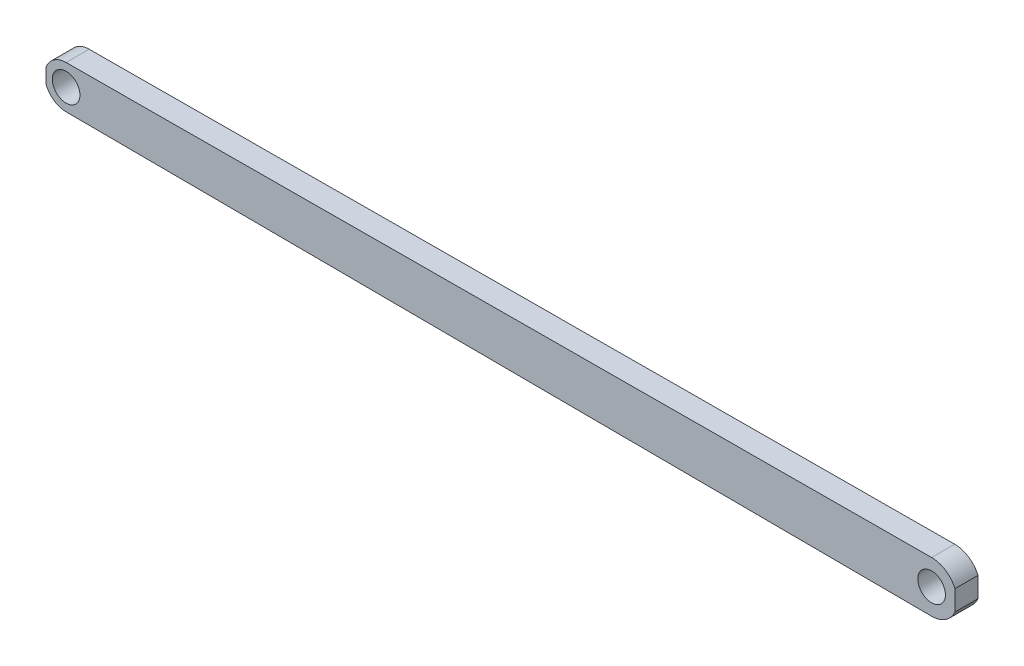
ISO-10303-21;
HEADER;
FILE_DESCRIPTION(('STEP AP214'),'2;1');
FILE_NAME('part.step','',(''),(''),'','','');
FILE_SCHEMA(('AUTOMOTIVE_DESIGN { 1 0 10303 214 1 1 1 1 }'));
ENDSEC;
DATA;
#1=APPLICATION_CONTEXT('core data for automotive mechanical design processes');
#2=APPLICATION_PROTOCOL_DEFINITION('international standard','automotive_design',2000,#1);
#3=PRODUCT_CONTEXT('',#1,'mechanical');
#4=PRODUCT('Part','Part','',(#3));
#5=PRODUCT_RELATED_PRODUCT_CATEGORY('part','',(#4));
#6=PRODUCT_DEFINITION_FORMATION('','',#4);
#7=PRODUCT_DEFINITION_CONTEXT('part definition',#1,'design');
#8=PRODUCT_DEFINITION('design','',#6,#7);
#9=PRODUCT_DEFINITION_SHAPE('','',#8);
#10=(LENGTH_UNIT() NAMED_UNIT(*) SI_UNIT(.MILLI.,.METRE.));
#11=(NAMED_UNIT(*) PLANE_ANGLE_UNIT() SI_UNIT($,.RADIAN.));
#12=(NAMED_UNIT(*) SI_UNIT($,.STERADIAN.) SOLID_ANGLE_UNIT());
#13=UNCERTAINTY_MEASURE_WITH_UNIT(LENGTH_MEASURE(1.E-05),#10,'distance_accuracy_value','');
#14=(GEOMETRIC_REPRESENTATION_CONTEXT(3) GLOBAL_UNCERTAINTY_ASSIGNED_CONTEXT((#13)) GLOBAL_UNIT_ASSIGNED_CONTEXT((#10,
#11,#12)) REPRESENTATION_CONTEXT('',''));
#15=CARTESIAN_POINT('',(0.,0.,0.));
#16=DIRECTION('',(0.,0.,1.));
#17=DIRECTION('',(1.,0.,0.));
#18=AXIS2_PLACEMENT_3D('',#15,#16,#17);
#19=CARTESIAN_POINT('',(0.,0.,5.));
#20=DIRECTION('',(0.,0.,1.));
#21=DIRECTION('',(1.,0.,0.));
#22=AXIS2_PLACEMENT_3D('',#19,#20,#21);
#23=PLANE('',#22);
#24=CARTESIAN_POINT('',(187.7624,0.,5.));
#25=DIRECTION('',(0.,0.,1.));
#26=DIRECTION('',(1.,0.,0.));
#27=AXIS2_PLACEMENT_3D('',#24,#25,#26);
#28=CIRCLE('',#27,3.00000007924962);
#29=CARTESIAN_POINT('',(190.76240007925,0.,5.));
#30=VERTEX_POINT('',#29);
#31=EDGE_CURVE('E168',#30,#30,#28,.T.);
#32=ORIENTED_EDGE('',*,*,#31,.F.);
#33=EDGE_LOOP('',(#32));
#34=FACE_BOUND('',#33,.T.);
#35=CARTESIAN_POINT('',(0.,0.,5.));
#36=DIRECTION('',(0.,0.,1.));
#37=DIRECTION('',(1.,0.,0.));
#38=AXIS2_PLACEMENT_3D('',#35,#36,#37);
#39=CIRCLE('',#38,3.00000007924961);
#40=CARTESIAN_POINT('',(3.00000007924961,0.,5.));
#41=VERTEX_POINT('',#40);
#42=EDGE_CURVE('E139',#41,#41,#39,.T.);
#43=ORIENTED_EDGE('',*,*,#42,.F.);
#44=EDGE_LOOP('',(#43));
#45=FACE_BOUND('',#44,.T.);
#46=CARTESIAN_POINT('',(0.,0.,5.));
#47=DIRECTION('',(0.,0.,1.));
#48=DIRECTION('',(1.,0.,0.));
#49=AXIS2_PLACEMENT_3D('',#46,#47,#48);
#50=CIRCLE('',#49,4.63518821296482);
#51=CARTESIAN_POINT('',(0.,4.63518821296482,5.));
#52=VERTEX_POINT('',#51);
#53=CARTESIAN_POINT('',(-4.35681947691644,1.58211687784739,5.));
#54=VERTEX_POINT('',#53);
#55=EDGE_CURVE('E153',#52,#54,#50,.T.);
#56=ORIENTED_EDGE('',*,*,#55,.T.);
#57=DIRECTION('',(0.,1.,0.));
#58=VECTOR('',#57,1.);
#59=CARTESIAN_POINT('',(-4.35681947691644,0.,5.));
#60=LINE('',#59,#58);
#61=CARTESIAN_POINT('',(-4.35681947691644,-1.58211687784739,5.));
#62=VERTEX_POINT('',#61);
#63=EDGE_CURVE('E100',#62,#54,#60,.T.);
#64=ORIENTED_EDGE('',*,*,#63,.F.);
#65=CARTESIAN_POINT('',(0.,-4.63518821296482,5.));
#66=VERTEX_POINT('',#65);
#67=EDGE_CURVE('E150',#62,#66,#50,.T.);
#68=ORIENTED_EDGE('',*,*,#67,.T.);
#69=DIRECTION('',(-0.999988830954034,0.00472630587074901,0.));
#70=VECTOR('',#69,1.);
#71=CARTESIAN_POINT('',(-0.0219070725791288,-4.63508467228263,5.));
#72=LINE('',#71,#70);
#73=CARTESIAN_POINT('',(187.7624,-5.52262065816452,5.));
#74=VERTEX_POINT('',#73);
#75=EDGE_CURVE('E159',#74,#66,#72,.T.);
#76=ORIENTED_EDGE('',*,*,#75,.F.);
#77=CARTESIAN_POINT('',(187.7624,0.,5.));
#78=DIRECTION('',(0.,0.,1.));
#79=DIRECTION('',(1.,0.,0.));
#80=AXIS2_PLACEMENT_3D('',#77,#78,#79);
#81=CIRCLE('',#80,5.52262065816452);
#82=CARTESIAN_POINT('',(192.829341952088,-2.19668800428204,5.));
#83=VERTEX_POINT('',#82);
#84=EDGE_CURVE('E165',#74,#83,#81,.T.);
#85=ORIENTED_EDGE('',*,*,#84,.T.);
#86=DIRECTION('',(0.,-1.,0.));
#87=VECTOR('',#86,1.);
#88=CARTESIAN_POINT('',(192.829341952088,0.,5.));
#89=LINE('',#88,#87);
#90=CARTESIAN_POINT('',(192.829341952088,2.19668800428204,5.));
#91=VERTEX_POINT('',#90);
#92=EDGE_CURVE('E154',#91,#83,#89,.T.);
#93=ORIENTED_EDGE('',*,*,#92,.F.);
#94=CARTESIAN_POINT('',(187.7624,5.52262065816452,5.));
#95=VERTEX_POINT('',#94);
#96=EDGE_CURVE('E164',#91,#95,#81,.T.);
#97=ORIENTED_EDGE('',*,*,#96,.T.);
#98=DIRECTION('',(-0.999988830954034,-0.00472630587074901,0.));
#99=VECTOR('',#98,1.);
#100=CARTESIAN_POINT('',(-0.0219070725791288,4.63508467228263,5.));
#101=LINE('',#100,#99);
#102=EDGE_CURVE('E134',#95,#52,#101,.T.);
#103=ORIENTED_EDGE('',*,*,#102,.T.);
#104=EDGE_LOOP('',(#56,#64,#68,#76,#85,#93,#97,#103));
#105=FACE_BOUND('',#104,.T.);
#106=ADVANCED_FACE('F36',(#34,#45,#105),#23,.T.);
#107=CARTESIAN_POINT('',(0.,0.,0.));
#108=DIRECTION('',(0.,0.,1.));
#109=DIRECTION('',(1.,0.,0.));
#110=AXIS2_PLACEMENT_3D('',#107,#108,#109);
#111=PLANE('',#110);
#112=CARTESIAN_POINT('',(187.7624,0.,0.));
#113=DIRECTION('',(0.,0.,1.));
#114=DIRECTION('',(1.,0.,0.));
#115=AXIS2_PLACEMENT_3D('',#112,#113,#114);
#116=CIRCLE('',#115,3.00000007924962);
#117=CARTESIAN_POINT('',(190.76240007925,0.,0.));
#118=VERTEX_POINT('',#117);
#119=EDGE_CURVE('E128',#118,#118,#116,.T.);
#120=ORIENTED_EDGE('',*,*,#119,.T.);
#121=EDGE_LOOP('',(#120));
#122=FACE_BOUND('',#121,.T.);
#123=CARTESIAN_POINT('',(0.,0.,0.));
#124=DIRECTION('',(0.,0.,1.));
#125=DIRECTION('',(1.,0.,0.));
#126=AXIS2_PLACEMENT_3D('',#123,#124,#125);
#127=CIRCLE('',#126,3.00000007924961);
#128=CARTESIAN_POINT('',(3.00000007924961,0.,0.));
#129=VERTEX_POINT('',#128);
#130=EDGE_CURVE('E131',#129,#129,#127,.T.);
#131=ORIENTED_EDGE('',*,*,#130,.T.);
#132=EDGE_LOOP('',(#131));
#133=FACE_BOUND('',#132,.T.);
#134=DIRECTION('',(0.,1.,0.));
#135=VECTOR('',#134,1.);
#136=CARTESIAN_POINT('',(-4.35681947691644,0.,0.));
#137=LINE('',#136,#135);
#138=CARTESIAN_POINT('',(-4.35681947691644,-1.58211687784739,0.));
#139=VERTEX_POINT('',#138);
#140=CARTESIAN_POINT('',(-4.35681947691644,1.58211687784739,0.));
#141=VERTEX_POINT('',#140);
#142=EDGE_CURVE('E50',#139,#141,#137,.T.);
#143=ORIENTED_EDGE('',*,*,#142,.T.);
#144=CARTESIAN_POINT('',(0.,0.,0.));
#145=DIRECTION('',(0.,0.,1.));
#146=DIRECTION('',(1.,0.,0.));
#147=AXIS2_PLACEMENT_3D('',#144,#145,#146);
#148=CIRCLE('',#147,4.63518821296482);
#149=CARTESIAN_POINT('',(0.,4.63518821296482,0.));
#150=VERTEX_POINT('',#149);
#151=EDGE_CURVE('E108',#150,#141,#148,.T.);
#152=ORIENTED_EDGE('',*,*,#151,.F.);
#153=DIRECTION('',(-0.999988830954034,-0.00472630587074901,0.));
#154=VECTOR('',#153,1.);
#155=CARTESIAN_POINT('',(-0.0219070725791288,4.63508467228263,0.));
#156=LINE('',#155,#154);
#157=CARTESIAN_POINT('',(187.7624,5.52262065816452,0.));
#158=VERTEX_POINT('',#157);
#159=EDGE_CURVE('E121',#158,#150,#156,.T.);
#160=ORIENTED_EDGE('',*,*,#159,.F.);
#161=CARTESIAN_POINT('',(187.7624,0.,0.));
#162=DIRECTION('',(0.,0.,1.));
#163=DIRECTION('',(1.,0.,0.));
#164=AXIS2_PLACEMENT_3D('',#161,#162,#163);
#165=CIRCLE('',#164,5.52262065816452);
#166=CARTESIAN_POINT('',(192.829341952088,2.19668800428204,0.));
#167=VERTEX_POINT('',#166);
#168=EDGE_CURVE('E119',#167,#158,#165,.T.);
#169=ORIENTED_EDGE('',*,*,#168,.F.);
#170=DIRECTION('',(0.,1.,0.));
#171=VECTOR('',#170,1.);
#172=CARTESIAN_POINT('',(192.829341952088,0.,0.));
#173=LINE('',#172,#171);
#174=CARTESIAN_POINT('',(192.829341952088,-2.19668800428204,0.));
#175=VERTEX_POINT('',#174);
#176=EDGE_CURVE('E145',#175,#167,#173,.T.);
#177=ORIENTED_EDGE('',*,*,#176,.F.);
#178=CARTESIAN_POINT('',(187.7624,-5.52262065816452,0.));
#179=VERTEX_POINT('',#178);
#180=EDGE_CURVE('E125',#179,#175,#165,.T.);
#181=ORIENTED_EDGE('',*,*,#180,.F.);
#182=DIRECTION('',(-0.999988830954034,0.00472630587074901,0.));
#183=VECTOR('',#182,1.);
#184=CARTESIAN_POINT('',(-0.0219070725791288,-4.63508467228263,0.));
#185=LINE('',#184,#183);
#186=CARTESIAN_POINT('',(0.,-4.63518821296482,0.));
#187=VERTEX_POINT('',#186);
#188=EDGE_CURVE('E117',#179,#187,#185,.T.);
#189=ORIENTED_EDGE('',*,*,#188,.T.);
#190=EDGE_CURVE('E111',#139,#187,#148,.T.);
#191=ORIENTED_EDGE('',*,*,#190,.F.);
#192=EDGE_LOOP('',(#143,#152,#160,#169,#177,#181,#189,#191));
#193=FACE_BOUND('',#192,.T.);
#194=ADVANCED_FACE('F106',(#122,#133,#193),#111,.F.);
#195=CARTESIAN_POINT('',(0.,0.,5.));
#196=DIRECTION('',(0.,0.,-1.));
#197=DIRECTION('',(-1.,0.,0.));
#198=AXIS2_PLACEMENT_3D('',#195,#196,#197);
#199=CYLINDRICAL_SURFACE('',#198,4.63518821296482);
#200=DIRECTION('',(0.,0.,-1.));
#201=VECTOR('',#200,1.);
#202=CARTESIAN_POINT('',(-4.35681947691644,1.58211687784739,5.));
#203=LINE('',#202,#201);
#204=EDGE_CURVE('E11',#54,#141,#203,.T.);
#205=ORIENTED_EDGE('',*,*,#204,.F.);
#206=ORIENTED_EDGE('',*,*,#55,.F.);
#207=DIRECTION('',(0.,0.,-1.));
#208=VECTOR('',#207,1.);
#209=CARTESIAN_POINT('',(0.,4.63518821296482,5.));
#210=LINE('',#209,#208);
#211=EDGE_CURVE('E115',#52,#150,#210,.T.);
#212=ORIENTED_EDGE('',*,*,#211,.T.);
#213=ORIENTED_EDGE('',*,*,#151,.T.);
#214=EDGE_LOOP('',(#205,#206,#212,#213));
#215=FACE_BOUND('',#214,.T.);
#216=ADVANCED_FACE('F113',(#215),#199,.T.);
#217=DIRECTION('',(0.,0.,-1.));
#218=VECTOR('',#217,1.);
#219=CARTESIAN_POINT('',(-4.35681947691644,-1.58211687784739,5.));
#220=LINE('',#219,#218);
#221=EDGE_CURVE('E44',#139,#62,#220,.F.);
#222=ORIENTED_EDGE('',*,*,#221,.F.);
#223=ORIENTED_EDGE('',*,*,#190,.T.);
#224=DIRECTION('',(0.,0.,-1.));
#225=VECTOR('',#224,1.);
#226=CARTESIAN_POINT('',(0.,-4.63518821296482,5.));
#227=LINE('',#226,#225);
#228=EDGE_CURVE('E141',#66,#187,#227,.T.);
#229=ORIENTED_EDGE('',*,*,#228,.F.);
#230=ORIENTED_EDGE('',*,*,#67,.F.);
#231=EDGE_LOOP('',(#222,#223,#229,#230));
#232=FACE_BOUND('',#231,.T.);
#233=ADVANCED_FACE('F156',(#232),#199,.T.);
#234=CARTESIAN_POINT('',(187.7624,0.,5.));
#235=DIRECTION('',(0.,0.,-1.));
#236=DIRECTION('',(-1.,0.,0.));
#237=AXIS2_PLACEMENT_3D('',#234,#235,#236);
#238=CYLINDRICAL_SURFACE('',#237,5.52262065816452);
#239=DIRECTION('',(0.,0.,-1.));
#240=VECTOR('',#239,1.);
#241=CARTESIAN_POINT('',(192.829341952088,-2.19668800428204,5.));
#242=LINE('',#241,#240);
#243=EDGE_CURVE('E58',#83,#175,#242,.T.);
#244=ORIENTED_EDGE('',*,*,#243,.F.);
#245=ORIENTED_EDGE('',*,*,#84,.F.);
#246=DIRECTION('',(0.,0.,-1.));
#247=VECTOR('',#246,1.);
#248=CARTESIAN_POINT('',(187.7624,-5.52262065816452,5.));
#249=LINE('',#248,#247);
#250=EDGE_CURVE('E138',#74,#179,#249,.T.);
#251=ORIENTED_EDGE('',*,*,#250,.T.);
#252=ORIENTED_EDGE('',*,*,#180,.T.);
#253=EDGE_LOOP('',(#244,#245,#251,#252));
#254=FACE_BOUND('',#253,.T.);
#255=ADVANCED_FACE('F196',(#254),#238,.T.);
#256=DIRECTION('',(0.,0.,-1.));
#257=VECTOR('',#256,1.);
#258=CARTESIAN_POINT('',(192.829341952088,2.19668800428204,5.));
#259=LINE('',#258,#257);
#260=EDGE_CURVE('E332',#167,#91,#259,.F.);
#261=ORIENTED_EDGE('',*,*,#260,.F.);
#262=ORIENTED_EDGE('',*,*,#168,.T.);
#263=DIRECTION('',(0.,0.,-1.));
#264=VECTOR('',#263,1.);
#265=CARTESIAN_POINT('',(187.7624,5.52262065816452,5.));
#266=LINE('',#265,#264);
#267=EDGE_CURVE('E135',#95,#158,#266,.T.);
#268=ORIENTED_EDGE('',*,*,#267,.F.);
#269=ORIENTED_EDGE('',*,*,#96,.F.);
#270=EDGE_LOOP('',(#261,#262,#268,#269));
#271=FACE_BOUND('',#270,.T.);
#272=ADVANCED_FACE('F199',(#271),#238,.T.);
#273=CARTESIAN_POINT('',(-0.0219070725791288,4.63508467228263,5.));
#274=DIRECTION('',(0.00472630587074901,-0.999988830954034,0.));
#275=DIRECTION('',(0.999988830954034,0.00472630587074901,0.));
#276=AXIS2_PLACEMENT_3D('',#273,#274,#275);
#277=PLANE('',#276);
#278=ORIENTED_EDGE('',*,*,#159,.T.);
#279=ORIENTED_EDGE('',*,*,#211,.F.);
#280=ORIENTED_EDGE('',*,*,#102,.F.);
#281=ORIENTED_EDGE('',*,*,#267,.T.);
#282=EDGE_LOOP('',(#278,#279,#280,#281));
#283=FACE_BOUND('',#282,.T.);
#284=ADVANCED_FACE('F38',(#283),#277,.F.);
#285=CARTESIAN_POINT('',(-0.0219070725791288,-4.63508467228263,5.));
#286=DIRECTION('',(-0.00472630587074901,-0.999988830954034,0.));
#287=DIRECTION('',(0.999988830954034,-0.00472630587074901,0.));
#288=AXIS2_PLACEMENT_3D('',#285,#286,#287);
#289=PLANE('',#288);
#290=ORIENTED_EDGE('',*,*,#188,.F.);
#291=ORIENTED_EDGE('',*,*,#250,.F.);
#292=ORIENTED_EDGE('',*,*,#75,.T.);
#293=ORIENTED_EDGE('',*,*,#228,.T.);
#294=EDGE_LOOP('',(#290,#291,#292,#293));
#295=FACE_BOUND('',#294,.T.);
#296=ADVANCED_FACE('F194',(#295),#289,.T.);
#297=CARTESIAN_POINT('',(187.7624,0.,5.));
#298=DIRECTION('',(0.,0.,-1.));
#299=DIRECTION('',(-1.,0.,0.));
#300=AXIS2_PLACEMENT_3D('',#297,#298,#299);
#301=CYLINDRICAL_SURFACE('',#300,3.00000007924962);
#302=ORIENTED_EDGE('',*,*,#31,.T.);
#303=EDGE_LOOP('',(#302));
#304=FACE_BOUND('',#303,.T.);
#305=ORIENTED_EDGE('',*,*,#119,.F.);
#306=EDGE_LOOP('',(#305));
#307=FACE_BOUND('',#306,.T.);
#308=ADVANCED_FACE('F191',(#304,#307),#301,.F.);
#309=CARTESIAN_POINT('',(0.,0.,5.));
#310=DIRECTION('',(0.,0.,-1.));
#311=DIRECTION('',(-1.,0.,0.));
#312=AXIS2_PLACEMENT_3D('',#309,#310,#311);
#313=CYLINDRICAL_SURFACE('',#312,3.00000007924961);
#314=ORIENTED_EDGE('',*,*,#42,.T.);
#315=EDGE_LOOP('',(#314));
#316=FACE_BOUND('',#315,.T.);
#317=ORIENTED_EDGE('',*,*,#130,.F.);
#318=EDGE_LOOP('',(#317));
#319=FACE_BOUND('',#318,.T.);
#320=ADVANCED_FACE('F173',(#316,#319),#313,.F.);
#321=CARTESIAN_POINT('',(192.829341952088,0.,5.));
#322=DIRECTION('',(1.,0.,0.));
#323=DIRECTION('',(0.,0.,-1.));
#324=AXIS2_PLACEMENT_3D('',#321,#322,#323);
#325=PLANE('',#324);
#326=ORIENTED_EDGE('',*,*,#243,.T.);
#327=ORIENTED_EDGE('',*,*,#176,.T.);
#328=ORIENTED_EDGE('',*,*,#260,.T.);
#329=ORIENTED_EDGE('',*,*,#92,.T.);
#330=EDGE_LOOP('',(#326,#327,#328,#329));
#331=FACE_BOUND('',#330,.T.);
#332=ADVANCED_FACE('F186',(#331),#325,.T.);
#333=CARTESIAN_POINT('',(-4.35681947691644,0.,5.));
#334=DIRECTION('',(-1.,0.,0.));
#335=DIRECTION('',(0.,0.,1.));
#336=AXIS2_PLACEMENT_3D('',#333,#334,#335);
#337=PLANE('',#336);
#338=ORIENTED_EDGE('',*,*,#204,.T.);
#339=ORIENTED_EDGE('',*,*,#142,.F.);
#340=ORIENTED_EDGE('',*,*,#221,.T.);
#341=ORIENTED_EDGE('',*,*,#63,.T.);
#342=EDGE_LOOP('',(#338,#339,#340,#341));
#343=FACE_BOUND('',#342,.T.);
#344=ADVANCED_FACE('F98',(#343),#337,.T.);
#345=CLOSED_SHELL('',(#106,#194,#216,#233,#255,#272,#284,#296,#308,#320,#332,#344));
#346=MANIFOLD_SOLID_BREP('B2',#345);
#347=ADVANCED_BREP_SHAPE_REPRESENTATION('',(#18,#346),#14);
#348=SHAPE_DEFINITION_REPRESENTATION(#9,#347);
ENDSEC;
END-ISO-10303-21;
